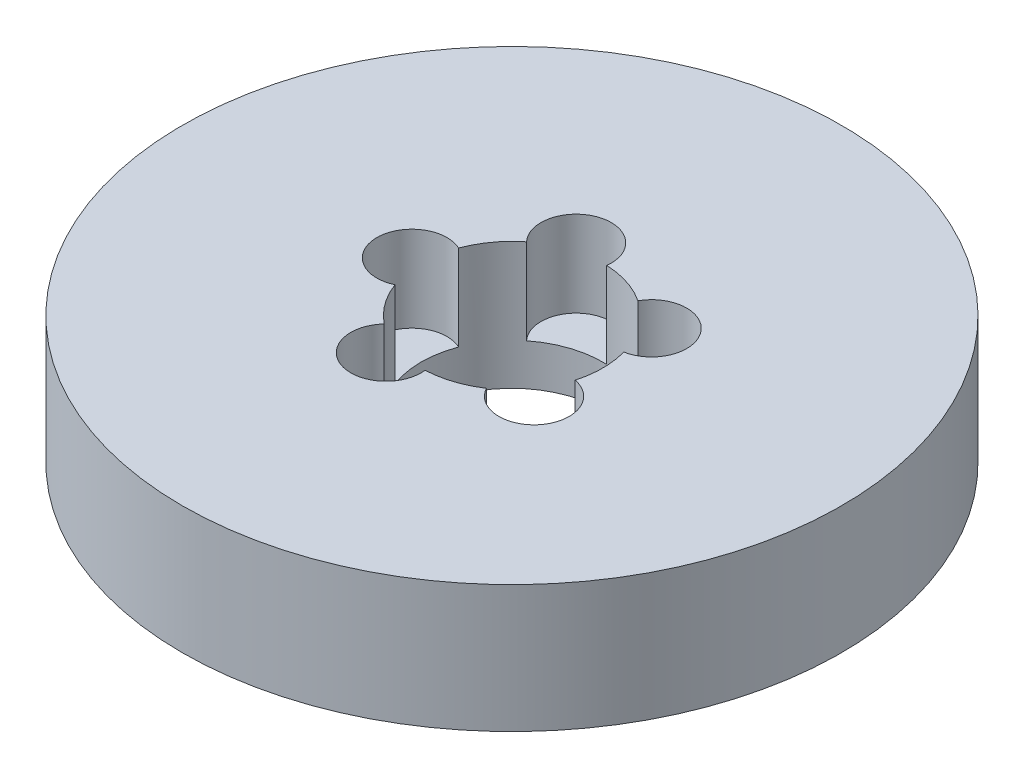
ISO-10303-21;
HEADER;
FILE_DESCRIPTION(('STEP AP214'),'2;1');
FILE_NAME('part.step','',(''),(''),'','','');
FILE_SCHEMA(('AUTOMOTIVE_DESIGN { 1 0 10303 214 1 1 1 1 }'));
ENDSEC;
DATA;
#1=APPLICATION_CONTEXT('core data for automotive mechanical design processes');
#2=APPLICATION_PROTOCOL_DEFINITION('international standard','automotive_design',2000,#1);
#3=PRODUCT_CONTEXT('',#1,'mechanical');
#4=PRODUCT('Part','Part','',(#3));
#5=PRODUCT_RELATED_PRODUCT_CATEGORY('part','',(#4));
#6=PRODUCT_DEFINITION_FORMATION('','',#4);
#7=PRODUCT_DEFINITION_CONTEXT('part definition',#1,'design');
#8=PRODUCT_DEFINITION('design','',#6,#7);
#9=PRODUCT_DEFINITION_SHAPE('','',#8);
#10=(LENGTH_UNIT() NAMED_UNIT(*) SI_UNIT(.MILLI.,.METRE.));
#11=(NAMED_UNIT(*) PLANE_ANGLE_UNIT() SI_UNIT($,.RADIAN.));
#12=(NAMED_UNIT(*) SI_UNIT($,.STERADIAN.) SOLID_ANGLE_UNIT());
#13=UNCERTAINTY_MEASURE_WITH_UNIT(LENGTH_MEASURE(1.E-05),#10,'distance_accuracy_value','');
#14=(GEOMETRIC_REPRESENTATION_CONTEXT(3) GLOBAL_UNCERTAINTY_ASSIGNED_CONTEXT((#13)) GLOBAL_UNIT_ASSIGNED_CONTEXT((#10,
#11,#12)) REPRESENTATION_CONTEXT('',''));
#15=CARTESIAN_POINT('',(0.,0.,0.));
#16=DIRECTION('',(0.,0.,1.));
#17=DIRECTION('',(1.,0.,0.));
#18=AXIS2_PLACEMENT_3D('',#15,#16,#17);
#19=CARTESIAN_POINT('',(0.,28.,0.));
#20=DIRECTION('',(0.,-1.,0.));
#21=DIRECTION('',(0.,0.,-1.));
#22=AXIS2_PLACEMENT_3D('',#19,#20,#21);
#23=CYLINDRICAL_SURFACE('',#22,72.5);
#24=CARTESIAN_POINT('',(0.,28.,0.));
#25=DIRECTION('',(0.,1.,0.));
#26=DIRECTION('',(0.,0.,1.));
#27=AXIS2_PLACEMENT_3D('',#24,#25,#26);
#28=CIRCLE('',#27,72.5);
#29=CARTESIAN_POINT('',(0.,28.,72.5));
#30=VERTEX_POINT('',#29);
#31=EDGE_CURVE('E157',#30,#30,#28,.T.);
#32=ORIENTED_EDGE('',*,*,#31,.F.);
#33=EDGE_LOOP('',(#32));
#34=FACE_BOUND('',#33,.T.);
#35=CARTESIAN_POINT('',(0.,0.,0.));
#36=DIRECTION('',(0.,1.,0.));
#37=DIRECTION('',(0.,0.,1.));
#38=AXIS2_PLACEMENT_3D('',#35,#36,#37);
#39=CIRCLE('',#38,72.5);
#40=CARTESIAN_POINT('',(0.,0.,72.5));
#41=VERTEX_POINT('',#40);
#42=EDGE_CURVE('E150',#41,#41,#39,.T.);
#43=ORIENTED_EDGE('',*,*,#42,.T.);
#44=EDGE_LOOP('',(#43));
#45=FACE_BOUND('',#44,.T.);
#46=ADVANCED_FACE('F39',(#34,#45),#23,.T.);
#47=CARTESIAN_POINT('',(0.,28.,0.));
#48=DIRECTION('',(0.,1.,0.));
#49=DIRECTION('',(0.,0.,1.));
#50=AXIS2_PLACEMENT_3D('',#47,#48,#49);
#51=PLANE('',#50);
#52=CARTESIAN_POINT('',(-6.79788333895658,28.,-20.9217336399438));
#53=DIRECTION('',(0.,1.,0.));
#54=DIRECTION('',(-0.95105651629515,0.,0.309016994374958));
#55=AXIS2_PLACEMENT_3D('',#52,#53,#54);
#56=CIRCLE('',#55,7.72482795080113);
#57=CARTESIAN_POINT('',(0.869460413956898,28.,-19.9810920269279));
#58=VERTEX_POINT('',#57);
#59=CARTESIAN_POINT('',(-12.4479994689547,28.,-15.6539870071782));
#60=VERTEX_POINT('',#59);
#61=EDGE_CURVE('E194',#58,#60,#56,.T.);
#62=ORIENTED_EDGE('',*,*,#61,.F.);
#63=CARTESIAN_POINT('',(0.,28.,0.));
#64=DIRECTION('',(0.,1.,0.));
#65=DIRECTION('',(0.,0.,1.));
#66=AXIS2_PLACEMENT_3D('',#63,#64,#65);
#67=CIRCLE('',#66,20.);
#68=CARTESIAN_POINT('',(11.0411829672992,28.,-16.6760990247306));
#69=VERTEX_POINT('',#68);
#70=EDGE_CURVE('E147',#69,#58,#67,.T.);
#71=ORIENTED_EDGE('',*,*,#70,.F.);
#72=CARTESIAN_POINT('',(17.7970896329442,28.,-12.9303424930575));
#73=DIRECTION('',(0.,1.,0.));
#74=DIRECTION('',(-0.58778525229248,0.,-0.809016994374942));
#75=AXIS2_PLACEMENT_3D('',#72,#73,#74);
#76=CIRCLE('',#75,7.72482795080113);
#77=CARTESIAN_POINT('',(19.2718258187519,28.,-5.34759101013605));
#78=VERTEX_POINT('',#77);
#79=EDGE_CURVE('E254',#78,#69,#76,.T.);
#80=ORIENTED_EDGE('',*,*,#79,.F.);
#81=CARTESIAN_POINT('',(19.271825818752,28.,5.34759101013577));
#82=VERTEX_POINT('',#81);
#83=EDGE_CURVE('E144',#82,#78,#67,.T.);
#84=ORIENTED_EDGE('',*,*,#83,.F.);
#85=CARTESIAN_POINT('',(17.7970896329444,28.,12.9303424930573));
#86=DIRECTION('',(0.,1.,0.));
#87=DIRECTION('',(0.587785252292469,0.,-0.809016994374951));
#88=AXIS2_PLACEMENT_3D('',#85,#86,#87);
#89=CIRCLE('',#88,7.72482795080113);
#90=CARTESIAN_POINT('',(11.0411829672994,28.,16.6760990247305));
#91=VERTEX_POINT('',#90);
#92=EDGE_CURVE('E141',#91,#82,#89,.T.);
#93=ORIENTED_EDGE('',*,*,#92,.F.);
#94=CARTESIAN_POINT('',(0.869460413957178,28.,19.9810920269279));
#95=VERTEX_POINT('',#94);
#96=EDGE_CURVE('E134',#95,#91,#67,.T.);
#97=ORIENTED_EDGE('',*,*,#96,.F.);
#98=CARTESIAN_POINT('',(-6.79788333895628,28.,20.9217336399439));
#99=DIRECTION('',(0.,1.,0.));
#100=DIRECTION('',(0.951056516295155,0.,0.309016994374945));
#101=AXIS2_PLACEMENT_3D('',#98,#99,#100);
#102=CIRCLE('',#101,7.72482795080113);
#103=CARTESIAN_POINT('',(-12.4479994689545,28.,15.6539870071784));
#104=VERTEX_POINT('',#103);
#105=EDGE_CURVE('E111',#104,#95,#102,.T.);
#106=ORIENTED_EDGE('',*,*,#105,.F.);
#107=CARTESIAN_POINT('',(-18.7344697310539,28.,7.00140299484509));
#108=VERTEX_POINT('',#107);
#109=EDGE_CURVE('E145',#108,#104,#67,.T.);
#110=ORIENTED_EDGE('',*,*,#109,.F.);
#111=CARTESIAN_POINT('',(-21.998412587976,28.,0.));
#112=DIRECTION('',(0.,1.,0.));
#113=DIRECTION('',(0.,0.,1.));
#114=AXIS2_PLACEMENT_3D('',#111,#112,#113);
#115=CIRCLE('',#114,7.72482795080113);
#116=CARTESIAN_POINT('',(-18.7344697310539,28.,-7.00140299484509));
#117=VERTEX_POINT('',#116);
#118=EDGE_CURVE('E153',#117,#108,#115,.T.);
#119=ORIENTED_EDGE('',*,*,#118,.F.);
#120=EDGE_CURVE('E146',#60,#117,#67,.T.);
#121=ORIENTED_EDGE('',*,*,#120,.F.);
#122=EDGE_LOOP('',(#62,#71,#80,#84,#93,#97,#106,#110,#119,#121));
#123=FACE_BOUND('',#122,.T.);
#124=ORIENTED_EDGE('',*,*,#31,.T.);
#125=EDGE_LOOP('',(#124));
#126=FACE_BOUND('',#125,.T.);
#127=ADVANCED_FACE('F139',(#123,#126),#51,.T.);
#128=CARTESIAN_POINT('',(0.,0.,0.));
#129=DIRECTION('',(0.,1.,0.));
#130=DIRECTION('',(0.,0.,1.));
#131=AXIS2_PLACEMENT_3D('',#128,#129,#130);
#132=PLANE('',#131);
#133=CARTESIAN_POINT('',(0.,0.,0.));
#134=DIRECTION('',(0.,1.,0.));
#135=DIRECTION('',(0.,0.,1.));
#136=AXIS2_PLACEMENT_3D('',#133,#134,#135);
#137=CIRCLE('',#136,20.);
#138=CARTESIAN_POINT('',(0.,0.,20.));
#139=VERTEX_POINT('',#138);
#140=EDGE_CURVE('E154',#139,#139,#137,.T.);
#141=ORIENTED_EDGE('',*,*,#140,.T.);
#142=EDGE_LOOP('',(#141));
#143=FACE_BOUND('',#142,.T.);
#144=ORIENTED_EDGE('',*,*,#42,.F.);
#145=EDGE_LOOP('',(#144));
#146=FACE_BOUND('',#145,.T.);
#147=ADVANCED_FACE('F213',(#143,#146),#132,.F.);
#148=CARTESIAN_POINT('',(0.,28.,0.));
#149=DIRECTION('',(0.,-1.,0.));
#150=DIRECTION('',(0.,0.,-1.));
#151=AXIS2_PLACEMENT_3D('',#148,#149,#150);
#152=CYLINDRICAL_SURFACE('',#151,20.);
#153=DIRECTION('',(0.,1.,0.));
#154=VECTOR('',#153,1.);
#155=CARTESIAN_POINT('',(0.869460413956897,18.5699162050295,-19.9810920269279));
#156=LINE('',#155,#154);
#157=CARTESIAN_POINT('',(0.869460413956898,9.13983241005893,-19.9810920269279));
#158=VERTEX_POINT('',#157);
#159=EDGE_CURVE('E11',#158,#58,#156,.T.);
#160=ORIENTED_EDGE('',*,*,#159,.F.);
#161=CARTESIAN_POINT('',(0.,9.13983241005893,0.));
#162=DIRECTION('',(0.,1.,0.));
#163=DIRECTION('',(0.,0.,1.));
#164=AXIS2_PLACEMENT_3D('',#161,#162,#163);
#165=CIRCLE('',#164,20.);
#166=CARTESIAN_POINT('',(-12.4479994689547,9.13983241005893,-15.6539870071782));
#167=VERTEX_POINT('',#166);
#168=EDGE_CURVE('E189',#158,#167,#165,.T.);
#169=ORIENTED_EDGE('',*,*,#168,.T.);
#170=DIRECTION('',(0.,1.,0.));
#171=VECTOR('',#170,1.);
#172=CARTESIAN_POINT('',(-12.4479994689547,18.5699162050295,-15.6539870071782));
#173=LINE('',#172,#171);
#174=EDGE_CURVE('E46',#60,#167,#173,.F.);
#175=ORIENTED_EDGE('',*,*,#174,.F.);
#176=ORIENTED_EDGE('',*,*,#120,.T.);
#177=DIRECTION('',(0.,1.,0.));
#178=VECTOR('',#177,1.);
#179=CARTESIAN_POINT('',(-18.7344697310539,18.5699162050295,-7.00140299484509));
#180=LINE('',#179,#178);
#181=CARTESIAN_POINT('',(-18.7344697310539,9.13983241005893,-7.00140299484509));
#182=VERTEX_POINT('',#181);
#183=EDGE_CURVE('E168',#182,#117,#180,.T.);
#184=ORIENTED_EDGE('',*,*,#183,.F.);
#185=CARTESIAN_POINT('',(0.,9.13983241005893,0.));
#186=DIRECTION('',(0.,1.,0.));
#187=DIRECTION('',(0.,0.,1.));
#188=AXIS2_PLACEMENT_3D('',#185,#186,#187);
#189=CIRCLE('',#188,20.);
#190=CARTESIAN_POINT('',(-18.7344697310539,9.13983241005893,7.00140299484509));
#191=VERTEX_POINT('',#190);
#192=EDGE_CURVE('E165',#182,#191,#189,.T.);
#193=ORIENTED_EDGE('',*,*,#192,.T.);
#194=DIRECTION('',(0.,1.,0.));
#195=VECTOR('',#194,1.);
#196=CARTESIAN_POINT('',(-18.7344697310539,18.5699162050295,7.00140299484509));
#197=LINE('',#196,#195);
#198=EDGE_CURVE('E170',#108,#191,#197,.F.);
#199=ORIENTED_EDGE('',*,*,#198,.F.);
#200=ORIENTED_EDGE('',*,*,#109,.T.);
#201=DIRECTION('',(0.,1.,0.));
#202=VECTOR('',#201,1.);
#203=CARTESIAN_POINT('',(-12.4479994689545,18.5699162050295,15.6539870071784));
#204=LINE('',#203,#202);
#205=CARTESIAN_POINT('',(-12.4479994689545,9.13983241005893,15.6539870071784));
#206=VERTEX_POINT('',#205);
#207=EDGE_CURVE('E121',#206,#104,#204,.T.);
#208=ORIENTED_EDGE('',*,*,#207,.F.);
#209=CARTESIAN_POINT('',(0.,9.13983241005893,0.));
#210=DIRECTION('',(0.,1.,0.));
#211=DIRECTION('',(0.,0.,1.));
#212=AXIS2_PLACEMENT_3D('',#209,#210,#211);
#213=CIRCLE('',#212,20.);
#214=CARTESIAN_POINT('',(0.869460413957178,9.13983241005893,19.9810920269279));
#215=VERTEX_POINT('',#214);
#216=EDGE_CURVE('E136',#206,#215,#213,.T.);
#217=ORIENTED_EDGE('',*,*,#216,.T.);
#218=DIRECTION('',(0.,1.,0.));
#219=VECTOR('',#218,1.);
#220=CARTESIAN_POINT('',(0.869460413957178,18.5699162050295,19.9810920269279));
#221=LINE('',#220,#219);
#222=EDGE_CURVE('E117',#95,#215,#221,.F.);
#223=ORIENTED_EDGE('',*,*,#222,.F.);
#224=ORIENTED_EDGE('',*,*,#96,.T.);
#225=DIRECTION('',(0.,1.,0.));
#226=VECTOR('',#225,1.);
#227=CARTESIAN_POINT('',(11.0411829672994,18.5699162050295,16.6760990247305));
#228=LINE('',#227,#226);
#229=CARTESIAN_POINT('',(11.0411829672994,9.13983241005893,16.6760990247305));
#230=VERTEX_POINT('',#229);
#231=EDGE_CURVE('E182',#230,#91,#228,.T.);
#232=ORIENTED_EDGE('',*,*,#231,.F.);
#233=CARTESIAN_POINT('',(0.,9.13983241005893,0.));
#234=DIRECTION('',(0.,1.,0.));
#235=DIRECTION('',(0.,0.,1.));
#236=AXIS2_PLACEMENT_3D('',#233,#234,#235);
#237=CIRCLE('',#236,20.);
#238=CARTESIAN_POINT('',(19.271825818752,9.13983241005893,5.34759101013577));
#239=VERTEX_POINT('',#238);
#240=EDGE_CURVE('E174',#230,#239,#237,.T.);
#241=ORIENTED_EDGE('',*,*,#240,.T.);
#242=DIRECTION('',(0.,1.,0.));
#243=VECTOR('',#242,1.);
#244=CARTESIAN_POINT('',(19.271825818752,18.5699162050295,5.34759101013577));
#245=LINE('',#244,#243);
#246=EDGE_CURVE('E177',#82,#239,#245,.F.);
#247=ORIENTED_EDGE('',*,*,#246,.F.);
#248=ORIENTED_EDGE('',*,*,#83,.T.);
#249=DIRECTION('',(0.,1.,0.));
#250=VECTOR('',#249,1.);
#251=CARTESIAN_POINT('',(19.2718258187519,18.5699162050295,-5.34759101013605));
#252=LINE('',#251,#250);
#253=CARTESIAN_POINT('',(19.2718258187519,9.13983241005893,-5.34759101013605));
#254=VERTEX_POINT('',#253);
#255=EDGE_CURVE('E187',#254,#78,#252,.T.);
#256=ORIENTED_EDGE('',*,*,#255,.F.);
#257=CARTESIAN_POINT('',(0.,9.13983241005893,0.));
#258=DIRECTION('',(0.,1.,0.));
#259=DIRECTION('',(0.,0.,1.));
#260=AXIS2_PLACEMENT_3D('',#257,#258,#259);
#261=CIRCLE('',#260,20.);
#262=CARTESIAN_POINT('',(11.0411829672992,9.13983241005893,-16.6760990247306));
#263=VERTEX_POINT('',#262);
#264=EDGE_CURVE('E181',#254,#263,#261,.T.);
#265=ORIENTED_EDGE('',*,*,#264,.T.);
#266=DIRECTION('',(0.,1.,0.));
#267=VECTOR('',#266,1.);
#268=CARTESIAN_POINT('',(11.0411829672992,18.5699162050295,-16.6760990247306));
#269=LINE('',#268,#267);
#270=EDGE_CURVE('E186',#69,#263,#269,.F.);
#271=ORIENTED_EDGE('',*,*,#270,.F.);
#272=ORIENTED_EDGE('',*,*,#70,.T.);
#273=EDGE_LOOP('',(#160,#169,#175,#176,#184,#193,#199,#200,#208,#217,#223,#224,#232,#241,#247,
#248,#256,#265,#271,#272));
#274=FACE_BOUND('',#273,.T.);
#275=ORIENTED_EDGE('',*,*,#140,.F.);
#276=EDGE_LOOP('',(#275));
#277=FACE_BOUND('',#276,.T.);
#278=ADVANCED_FACE('F135',(#274,#277),#152,.F.);
#279=CARTESIAN_POINT('',(-21.998412587976,9.13983241005893,0.));
#280=DIRECTION('',(0.,1.,0.));
#281=DIRECTION('',(0.,0.,1.));
#282=AXIS2_PLACEMENT_3D('',#279,#280,#281);
#283=CYLINDRICAL_SURFACE('',#282,7.72482795080113);
#284=ORIENTED_EDGE('',*,*,#183,.T.);
#285=ORIENTED_EDGE('',*,*,#118,.T.);
#286=ORIENTED_EDGE('',*,*,#198,.T.);
#287=CARTESIAN_POINT('',(-21.998412587976,9.13983241005893,0.));
#288=DIRECTION('',(0.,1.,0.));
#289=DIRECTION('',(0.,0.,1.));
#290=AXIS2_PLACEMENT_3D('',#287,#288,#289);
#291=CIRCLE('',#290,7.72482795080113);
#292=EDGE_CURVE('E158',#182,#191,#291,.T.);
#293=ORIENTED_EDGE('',*,*,#292,.F.);
#294=EDGE_LOOP('',(#284,#285,#286,#293));
#295=FACE_BOUND('',#294,.T.);
#296=ADVANCED_FACE('F221',(#295),#283,.F.);
#297=CARTESIAN_POINT('',(-21.998412587976,9.13983241005893,0.));
#298=DIRECTION('',(0.,1.,0.));
#299=DIRECTION('',(0.,0.,1.));
#300=AXIS2_PLACEMENT_3D('',#297,#298,#299);
#301=PLANE('',#300);
#302=ORIENTED_EDGE('',*,*,#292,.T.);
#303=ORIENTED_EDGE('',*,*,#192,.F.);
#304=EDGE_LOOP('',(#302,#303));
#305=FACE_BOUND('',#304,.T.);
#306=ADVANCED_FACE('F227',(#305),#301,.T.);
#307=CARTESIAN_POINT('',(-6.79788333895628,9.13983241005893,20.9217336399439));
#308=DIRECTION('',(0.,1.,0.));
#309=DIRECTION('',(0.,0.,1.));
#310=AXIS2_PLACEMENT_3D('',#307,#308,#309);
#311=CYLINDRICAL_SURFACE('',#310,7.72482795080113);
#312=ORIENTED_EDGE('',*,*,#207,.T.);
#313=ORIENTED_EDGE('',*,*,#105,.T.);
#314=ORIENTED_EDGE('',*,*,#222,.T.);
#315=CARTESIAN_POINT('',(-6.79788333895628,9.13983241005893,20.9217336399439));
#316=DIRECTION('',(0.,1.,0.));
#317=DIRECTION('',(0.951056516295155,0.,0.309016994374945));
#318=AXIS2_PLACEMENT_3D('',#315,#316,#317);
#319=CIRCLE('',#318,7.72482795080113);
#320=EDGE_CURVE('E127',#206,#215,#319,.T.);
#321=ORIENTED_EDGE('',*,*,#320,.F.);
#322=EDGE_LOOP('',(#312,#313,#314,#321));
#323=FACE_BOUND('',#322,.T.);
#324=ADVANCED_FACE('F116',(#323),#311,.F.);
#325=CARTESIAN_POINT('',(-6.79788333895628,9.13983241005893,20.9217336399439));
#326=DIRECTION('',(0.,1.,0.));
#327=DIRECTION('',(0.951056516295155,0.,0.309016994374945));
#328=AXIS2_PLACEMENT_3D('',#325,#326,#327);
#329=PLANE('',#328);
#330=ORIENTED_EDGE('',*,*,#320,.T.);
#331=ORIENTED_EDGE('',*,*,#216,.F.);
#332=EDGE_LOOP('',(#330,#331));
#333=FACE_BOUND('',#332,.T.);
#334=ADVANCED_FACE('F234',(#333),#329,.T.);
#335=CARTESIAN_POINT('',(17.7970896329444,9.13983241005893,12.9303424930573));
#336=DIRECTION('',(0.,1.,0.));
#337=DIRECTION('',(0.,0.,1.));
#338=AXIS2_PLACEMENT_3D('',#335,#336,#337);
#339=CYLINDRICAL_SURFACE('',#338,7.72482795080113);
#340=ORIENTED_EDGE('',*,*,#231,.T.);
#341=ORIENTED_EDGE('',*,*,#92,.T.);
#342=ORIENTED_EDGE('',*,*,#246,.T.);
#343=CARTESIAN_POINT('',(17.7970896329444,9.13983241005893,12.9303424930573));
#344=DIRECTION('',(0.,1.,0.));
#345=DIRECTION('',(0.587785252292469,0.,-0.809016994374951));
#346=AXIS2_PLACEMENT_3D('',#343,#344,#345);
#347=CIRCLE('',#346,7.72482795080113);
#348=EDGE_CURVE('E130',#230,#239,#347,.T.);
#349=ORIENTED_EDGE('',*,*,#348,.F.);
#350=EDGE_LOOP('',(#340,#341,#342,#349));
#351=FACE_BOUND('',#350,.T.);
#352=ADVANCED_FACE('F240',(#351),#339,.F.);
#353=CARTESIAN_POINT('',(17.7970896329444,9.13983241005893,12.9303424930573));
#354=DIRECTION('',(0.,1.,0.));
#355=DIRECTION('',(0.587785252292469,0.,-0.809016994374951));
#356=AXIS2_PLACEMENT_3D('',#353,#354,#355);
#357=PLANE('',#356);
#358=ORIENTED_EDGE('',*,*,#348,.T.);
#359=ORIENTED_EDGE('',*,*,#240,.F.);
#360=EDGE_LOOP('',(#358,#359));
#361=FACE_BOUND('',#360,.T.);
#362=ADVANCED_FACE('F245',(#361),#357,.T.);
#363=CARTESIAN_POINT('',(17.7970896329442,9.13983241005893,-12.9303424930575));
#364=DIRECTION('',(0.,1.,0.));
#365=DIRECTION('',(0.,0.,1.));
#366=AXIS2_PLACEMENT_3D('',#363,#364,#365);
#367=CYLINDRICAL_SURFACE('',#366,7.72482795080113);
#368=ORIENTED_EDGE('',*,*,#255,.T.);
#369=ORIENTED_EDGE('',*,*,#79,.T.);
#370=ORIENTED_EDGE('',*,*,#270,.T.);
#371=CARTESIAN_POINT('',(17.7970896329442,9.13983241005893,-12.9303424930575));
#372=DIRECTION('',(0.,1.,0.));
#373=DIRECTION('',(-0.58778525229248,0.,-0.809016994374942));
#374=AXIS2_PLACEMENT_3D('',#371,#372,#373);
#375=CIRCLE('',#374,7.72482795080113);
#376=EDGE_CURVE('E56',#254,#263,#375,.T.);
#377=ORIENTED_EDGE('',*,*,#376,.F.);
#378=EDGE_LOOP('',(#368,#369,#370,#377));
#379=FACE_BOUND('',#378,.T.);
#380=ADVANCED_FACE('F266',(#379),#367,.F.);
#381=CARTESIAN_POINT('',(17.7970896329442,9.13983241005893,-12.9303424930575));
#382=DIRECTION('',(0.,1.,0.));
#383=DIRECTION('',(-0.58778525229248,0.,-0.809016994374942));
#384=AXIS2_PLACEMENT_3D('',#381,#382,#383);
#385=PLANE('',#384);
#386=ORIENTED_EDGE('',*,*,#376,.T.);
#387=ORIENTED_EDGE('',*,*,#264,.F.);
#388=EDGE_LOOP('',(#386,#387));
#389=FACE_BOUND('',#388,.T.);
#390=ADVANCED_FACE('F204',(#389),#385,.T.);
#391=CARTESIAN_POINT('',(-6.79788333895658,9.13983241005893,-20.9217336399438));
#392=DIRECTION('',(0.,1.,0.));
#393=DIRECTION('',(0.,0.,1.));
#394=AXIS2_PLACEMENT_3D('',#391,#392,#393);
#395=CYLINDRICAL_SURFACE('',#394,7.72482795080113);
#396=ORIENTED_EDGE('',*,*,#159,.T.);
#397=ORIENTED_EDGE('',*,*,#61,.T.);
#398=ORIENTED_EDGE('',*,*,#174,.T.);
#399=CARTESIAN_POINT('',(-6.79788333895658,9.13983241005893,-20.9217336399438));
#400=DIRECTION('',(0.,1.,0.));
#401=DIRECTION('',(-0.95105651629515,0.,0.309016994374958));
#402=AXIS2_PLACEMENT_3D('',#399,#400,#401);
#403=CIRCLE('',#402,7.72482795080113);
#404=EDGE_CURVE('E55',#158,#167,#403,.T.);
#405=ORIENTED_EDGE('',*,*,#404,.F.);
#406=EDGE_LOOP('',(#396,#397,#398,#405));
#407=FACE_BOUND('',#406,.T.);
#408=ADVANCED_FACE('F193',(#407),#395,.F.);
#409=CARTESIAN_POINT('',(-6.79788333895658,9.13983241005893,-20.9217336399438));
#410=DIRECTION('',(0.,1.,0.));
#411=DIRECTION('',(-0.95105651629515,0.,0.309016994374958));
#412=AXIS2_PLACEMENT_3D('',#409,#410,#411);
#413=PLANE('',#412);
#414=ORIENTED_EDGE('',*,*,#404,.T.);
#415=ORIENTED_EDGE('',*,*,#168,.F.);
#416=EDGE_LOOP('',(#414,#415));
#417=FACE_BOUND('',#416,.T.);
#418=ADVANCED_FACE('F196',(#417),#413,.T.);
#419=CLOSED_SHELL('',(#46,#127,#147,#278,#296,#306,#324,#334,#352,#362,#380,#390,#408,#418));
#420=MANIFOLD_SOLID_BREP('B2',#419);
#421=ADVANCED_BREP_SHAPE_REPRESENTATION('',(#18,#420),#14);
#422=SHAPE_DEFINITION_REPRESENTATION(#9,#421);
ENDSEC;
END-ISO-10303-21;
